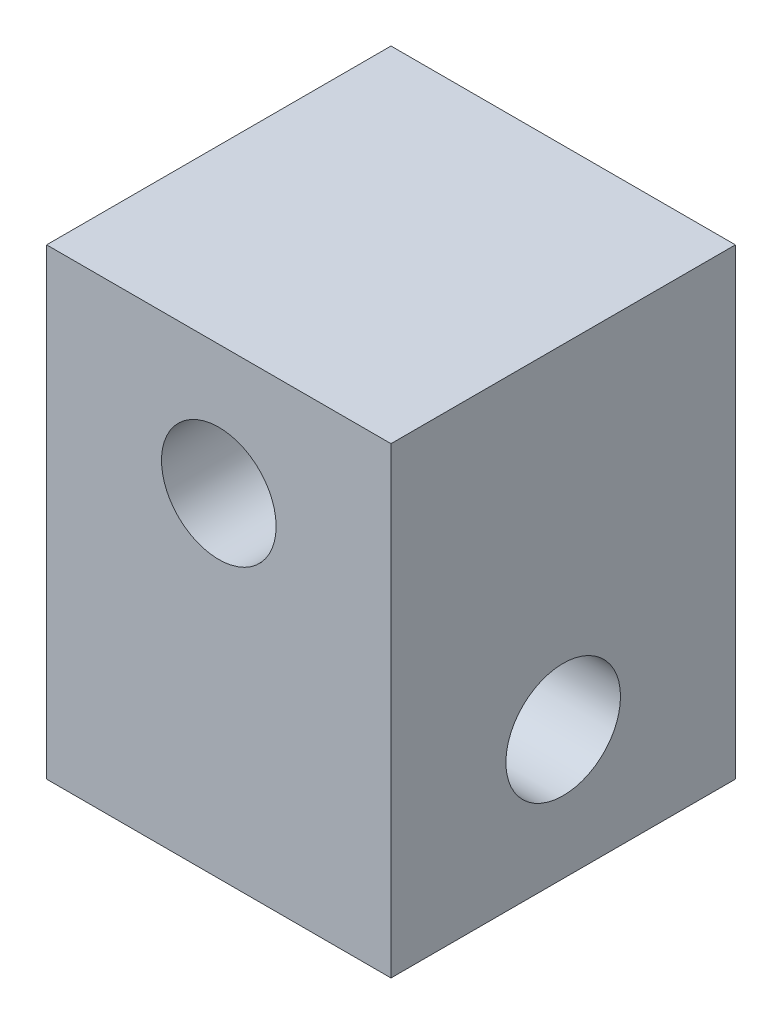
ISO-10303-21;
HEADER;
FILE_DESCRIPTION(('STEP AP214'),'2;1');
FILE_NAME('part.step','',(''),(''),'','','');
FILE_SCHEMA(('AUTOMOTIVE_DESIGN { 1 0 10303 214 1 1 1 1 }'));
ENDSEC;
DATA;
#1=APPLICATION_CONTEXT('core data for automotive mechanical design processes');
#2=APPLICATION_PROTOCOL_DEFINITION('international standard','automotive_design',2000,#1);
#3=PRODUCT_CONTEXT('',#1,'mechanical');
#4=PRODUCT('Part','Part','',(#3));
#5=PRODUCT_RELATED_PRODUCT_CATEGORY('part','',(#4));
#6=PRODUCT_DEFINITION_FORMATION('','',#4);
#7=PRODUCT_DEFINITION_CONTEXT('part definition',#1,'design');
#8=PRODUCT_DEFINITION('design','',#6,#7);
#9=PRODUCT_DEFINITION_SHAPE('','',#8);
#10=(LENGTH_UNIT() NAMED_UNIT(*) SI_UNIT(.MILLI.,.METRE.));
#11=(NAMED_UNIT(*) PLANE_ANGLE_UNIT() SI_UNIT($,.RADIAN.));
#12=(NAMED_UNIT(*) SI_UNIT($,.STERADIAN.) SOLID_ANGLE_UNIT());
#13=UNCERTAINTY_MEASURE_WITH_UNIT(LENGTH_MEASURE(1.E-05),#10,'distance_accuracy_value','');
#14=(GEOMETRIC_REPRESENTATION_CONTEXT(3) GLOBAL_UNCERTAINTY_ASSIGNED_CONTEXT((#13)) GLOBAL_UNIT_ASSIGNED_CONTEXT((#10,
#11,#12)) REPRESENTATION_CONTEXT('',''));
#15=CARTESIAN_POINT('',(0.,0.,0.));
#16=DIRECTION('',(0.,0.,1.));
#17=DIRECTION('',(1.,0.,0.));
#18=AXIS2_PLACEMENT_3D('',#15,#16,#17);
#19=CARTESIAN_POINT('',(4.064,0.,-4.064));
#20=DIRECTION('',(0.,-1.,0.));
#21=DIRECTION('',(0.,0.,-1.));
#22=AXIS2_PLACEMENT_3D('',#19,#20,#21);
#23=PLANE('',#22);
#24=DIRECTION('',(0.,0.,1.));
#25=VECTOR('',#24,1.);
#26=CARTESIAN_POINT('',(-4.064,0.,-4.064));
#27=LINE('',#26,#25);
#28=CARTESIAN_POINT('',(-4.064,0.,-4.064));
#29=VERTEX_POINT('',#28);
#30=CARTESIAN_POINT('',(-4.064,0.,4.064));
#31=VERTEX_POINT('',#30);
#32=EDGE_CURVE('E98',#29,#31,#27,.T.);
#33=ORIENTED_EDGE('',*,*,#32,.F.);
#34=DIRECTION('',(-1.,0.,0.));
#35=VECTOR('',#34,1.);
#36=CARTESIAN_POINT('',(4.064,0.,-4.064));
#37=LINE('',#36,#35);
#38=CARTESIAN_POINT('',(4.064,0.,-4.064));
#39=VERTEX_POINT('',#38);
#40=EDGE_CURVE('E11',#39,#29,#37,.T.);
#41=ORIENTED_EDGE('',*,*,#40,.F.);
#42=DIRECTION('',(0.,0.,1.));
#43=VECTOR('',#42,1.);
#44=CARTESIAN_POINT('',(4.064,0.,-4.064));
#45=LINE('',#44,#43);
#46=CARTESIAN_POINT('',(4.064,0.,4.064));
#47=VERTEX_POINT('',#46);
#48=EDGE_CURVE('E91',#39,#47,#45,.T.);
#49=ORIENTED_EDGE('',*,*,#48,.T.);
#50=DIRECTION('',(-1.,0.,0.));
#51=VECTOR('',#50,1.);
#52=CARTESIAN_POINT('',(4.064,0.,4.064));
#53=LINE('',#52,#51);
#54=EDGE_CURVE('E36',#47,#31,#53,.T.);
#55=ORIENTED_EDGE('',*,*,#54,.T.);
#56=EDGE_LOOP('',(#33,#41,#49,#55));
#57=FACE_BOUND('',#56,.T.);
#58=ADVANCED_FACE('F33',(#57),#23,.T.);
#59=CARTESIAN_POINT('',(4.064,10.922,-4.064));
#60=DIRECTION('',(0.,0.,-1.));
#61=DIRECTION('',(-1.,0.,0.));
#62=AXIS2_PLACEMENT_3D('',#59,#60,#61);
#63=PLANE('',#62);
#64=CARTESIAN_POINT('',(0.,7.874,-4.064));
#65=DIRECTION('',(0.,0.,1.));
#66=DIRECTION('',(1.,0.,0.));
#67=AXIS2_PLACEMENT_3D('',#64,#65,#66);
#68=CIRCLE('',#67,1.35254999999998);
#69=CARTESIAN_POINT('',(1.35254999999998,7.874,-4.064));
#70=VERTEX_POINT('',#69);
#71=EDGE_CURVE('E131',#70,#70,#68,.T.);
#72=ORIENTED_EDGE('',*,*,#71,.T.);
#73=EDGE_LOOP('',(#72));
#74=FACE_BOUND('',#73,.T.);
#75=DIRECTION('',(0.,-1.,0.));
#76=VECTOR('',#75,1.);
#77=CARTESIAN_POINT('',(-4.064,10.922,-4.064));
#78=LINE('',#77,#76);
#79=CARTESIAN_POINT('',(-4.064,10.922,-4.064));
#80=VERTEX_POINT('',#79);
#81=EDGE_CURVE('E93',#80,#29,#78,.T.);
#82=ORIENTED_EDGE('',*,*,#81,.F.);
#83=DIRECTION('',(-1.,0.,0.));
#84=VECTOR('',#83,1.);
#85=CARTESIAN_POINT('',(4.064,10.922,-4.064));
#86=LINE('',#85,#84);
#87=CARTESIAN_POINT('',(4.064,10.922,-4.064));
#88=VERTEX_POINT('',#87);
#89=EDGE_CURVE('E42',#88,#80,#86,.T.);
#90=ORIENTED_EDGE('',*,*,#89,.F.);
#91=DIRECTION('',(0.,-1.,0.));
#92=VECTOR('',#91,1.);
#93=CARTESIAN_POINT('',(4.064,10.922,-4.064));
#94=LINE('',#93,#92);
#95=EDGE_CURVE('E88',#88,#39,#94,.T.);
#96=ORIENTED_EDGE('',*,*,#95,.T.);
#97=ORIENTED_EDGE('',*,*,#40,.T.);
#98=EDGE_LOOP('',(#82,#90,#96,#97));
#99=FACE_BOUND('',#98,.T.);
#100=ADVANCED_FACE('F109',(#74,#99),#63,.T.);
#101=CARTESIAN_POINT('',(4.064,10.922,4.064));
#102=DIRECTION('',(0.,1.,0.));
#103=DIRECTION('',(0.,0.,1.));
#104=AXIS2_PLACEMENT_3D('',#101,#102,#103);
#105=PLANE('',#104);
#106=DIRECTION('',(0.,0.,-1.));
#107=VECTOR('',#106,1.);
#108=CARTESIAN_POINT('',(-4.064,10.922,4.064));
#109=LINE('',#108,#107);
#110=CARTESIAN_POINT('',(-4.064,10.922,4.064));
#111=VERTEX_POINT('',#110);
#112=EDGE_CURVE('E83',#111,#80,#109,.T.);
#113=ORIENTED_EDGE('',*,*,#112,.F.);
#114=DIRECTION('',(-1.,0.,0.));
#115=VECTOR('',#114,1.);
#116=CARTESIAN_POINT('',(4.064,10.922,4.064));
#117=LINE('',#116,#115);
#118=CARTESIAN_POINT('',(4.064,10.922,4.064));
#119=VERTEX_POINT('',#118);
#120=EDGE_CURVE('E78',#119,#111,#117,.T.);
#121=ORIENTED_EDGE('',*,*,#120,.F.);
#122=DIRECTION('',(0.,0.,-1.));
#123=VECTOR('',#122,1.);
#124=CARTESIAN_POINT('',(4.064,10.922,4.064));
#125=LINE('',#124,#123);
#126=EDGE_CURVE('E81',#119,#88,#125,.T.);
#127=ORIENTED_EDGE('',*,*,#126,.T.);
#128=ORIENTED_EDGE('',*,*,#89,.T.);
#129=EDGE_LOOP('',(#113,#121,#127,#128));
#130=FACE_BOUND('',#129,.T.);
#131=ADVANCED_FACE('F80',(#130),#105,.T.);
#132=CARTESIAN_POINT('',(4.064,0.,4.064));
#133=DIRECTION('',(0.,0.,1.));
#134=DIRECTION('',(1.,0.,0.));
#135=AXIS2_PLACEMENT_3D('',#132,#133,#134);
#136=PLANE('',#135);
#137=CARTESIAN_POINT('',(0.,7.874,4.064));
#138=DIRECTION('',(0.,0.,1.));
#139=DIRECTION('',(1.,0.,0.));
#140=AXIS2_PLACEMENT_3D('',#137,#138,#139);
#141=CIRCLE('',#140,1.35254999999998);
#142=CARTESIAN_POINT('',(1.35254999999998,7.874,4.064));
#143=VERTEX_POINT('',#142);
#144=EDGE_CURVE('E129',#143,#143,#141,.T.);
#145=ORIENTED_EDGE('',*,*,#144,.F.);
#146=EDGE_LOOP('',(#145));
#147=FACE_BOUND('',#146,.T.);
#148=DIRECTION('',(0.,1.,0.));
#149=VECTOR('',#148,1.);
#150=CARTESIAN_POINT('',(-4.064,0.,4.064));
#151=LINE('',#150,#149);
#152=EDGE_CURVE('E101',#31,#111,#151,.T.);
#153=ORIENTED_EDGE('',*,*,#152,.F.);
#154=ORIENTED_EDGE('',*,*,#54,.F.);
#155=DIRECTION('',(0.,1.,0.));
#156=VECTOR('',#155,1.);
#157=CARTESIAN_POINT('',(4.064,0.,4.064));
#158=LINE('',#157,#156);
#159=EDGE_CURVE('E87',#47,#119,#158,.T.);
#160=ORIENTED_EDGE('',*,*,#159,.T.);
#161=ORIENTED_EDGE('',*,*,#120,.T.);
#162=EDGE_LOOP('',(#153,#154,#160,#161));
#163=FACE_BOUND('',#162,.T.);
#164=ADVANCED_FACE('F90',(#147,#163),#136,.T.);
#165=CARTESIAN_POINT('',(4.064,0.,0.));
#166=DIRECTION('',(-1.,0.,0.));
#167=DIRECTION('',(0.,0.,1.));
#168=AXIS2_PLACEMENT_3D('',#165,#166,#167);
#169=PLANE('',#168);
#170=CARTESIAN_POINT('',(4.064,3.048,0.));
#171=DIRECTION('',(1.,0.,0.));
#172=DIRECTION('',(0.,0.,-1.));
#173=AXIS2_PLACEMENT_3D('',#170,#171,#172);
#174=CIRCLE('',#173,1.35254999999998);
#175=CARTESIAN_POINT('',(4.064,3.048,-1.35254999999998));
#176=VERTEX_POINT('',#175);
#177=EDGE_CURVE('E133',#176,#176,#174,.T.);
#178=ORIENTED_EDGE('',*,*,#177,.F.);
#179=EDGE_LOOP('',(#178));
#180=FACE_BOUND('',#179,.T.);
#181=ORIENTED_EDGE('',*,*,#48,.F.);
#182=ORIENTED_EDGE('',*,*,#95,.F.);
#183=ORIENTED_EDGE('',*,*,#126,.F.);
#184=ORIENTED_EDGE('',*,*,#159,.F.);
#185=EDGE_LOOP('',(#181,#182,#183,#184));
#186=FACE_BOUND('',#185,.T.);
#187=ADVANCED_FACE('F86',(#180,#186),#169,.F.);
#188=CARTESIAN_POINT('',(-4.064,0.,0.));
#189=DIRECTION('',(-1.,0.,0.));
#190=DIRECTION('',(0.,0.,1.));
#191=AXIS2_PLACEMENT_3D('',#188,#189,#190);
#192=PLANE('',#191);
#193=CARTESIAN_POINT('',(-4.064,3.048,0.));
#194=DIRECTION('',(1.,0.,0.));
#195=DIRECTION('',(0.,0.,-1.));
#196=AXIS2_PLACEMENT_3D('',#193,#194,#195);
#197=CIRCLE('',#196,1.35254999999998);
#198=CARTESIAN_POINT('',(-4.064,3.048,-1.35254999999998));
#199=VERTEX_POINT('',#198);
#200=EDGE_CURVE('E102',#199,#199,#197,.T.);
#201=ORIENTED_EDGE('',*,*,#200,.T.);
#202=EDGE_LOOP('',(#201));
#203=FACE_BOUND('',#202,.T.);
#204=ORIENTED_EDGE('',*,*,#32,.T.);
#205=ORIENTED_EDGE('',*,*,#152,.T.);
#206=ORIENTED_EDGE('',*,*,#112,.T.);
#207=ORIENTED_EDGE('',*,*,#81,.T.);
#208=EDGE_LOOP('',(#204,#205,#206,#207));
#209=FACE_BOUND('',#208,.T.);
#210=ADVANCED_FACE('F108',(#203,#209),#192,.T.);
#211=CARTESIAN_POINT('',(4.064,3.048,0.));
#212=DIRECTION('',(1.,0.,0.));
#213=DIRECTION('',(0.,0.,-1.));
#214=AXIS2_PLACEMENT_3D('',#211,#212,#213);
#215=CYLINDRICAL_SURFACE('',#214,1.35254999999998);
#216=ORIENTED_EDGE('',*,*,#200,.F.);
#217=EDGE_LOOP('',(#216));
#218=FACE_BOUND('',#217,.T.);
#219=ORIENTED_EDGE('',*,*,#177,.T.);
#220=EDGE_LOOP('',(#219));
#221=FACE_BOUND('',#220,.T.);
#222=ADVANCED_FACE('F141',(#218,#221),#215,.F.);
#223=CARTESIAN_POINT('',(0.,7.874,4.064));
#224=DIRECTION('',(0.,0.,1.));
#225=DIRECTION('',(1.,0.,0.));
#226=AXIS2_PLACEMENT_3D('',#223,#224,#225);
#227=CYLINDRICAL_SURFACE('',#226,1.35254999999998);
#228=ORIENTED_EDGE('',*,*,#71,.F.);
#229=EDGE_LOOP('',(#228));
#230=FACE_BOUND('',#229,.T.);
#231=ORIENTED_EDGE('',*,*,#144,.T.);
#232=EDGE_LOOP('',(#231));
#233=FACE_BOUND('',#232,.T.);
#234=ADVANCED_FACE('F144',(#230,#233),#227,.F.);
#235=CLOSED_SHELL('',(#58,#100,#131,#164,#187,#210,#222,#234));
#236=MANIFOLD_SOLID_BREP('B2',#235);
#237=ADVANCED_BREP_SHAPE_REPRESENTATION('',(#18,#236),#14);
#238=SHAPE_DEFINITION_REPRESENTATION(#9,#237);
ENDSEC;
END-ISO-10303-21;
